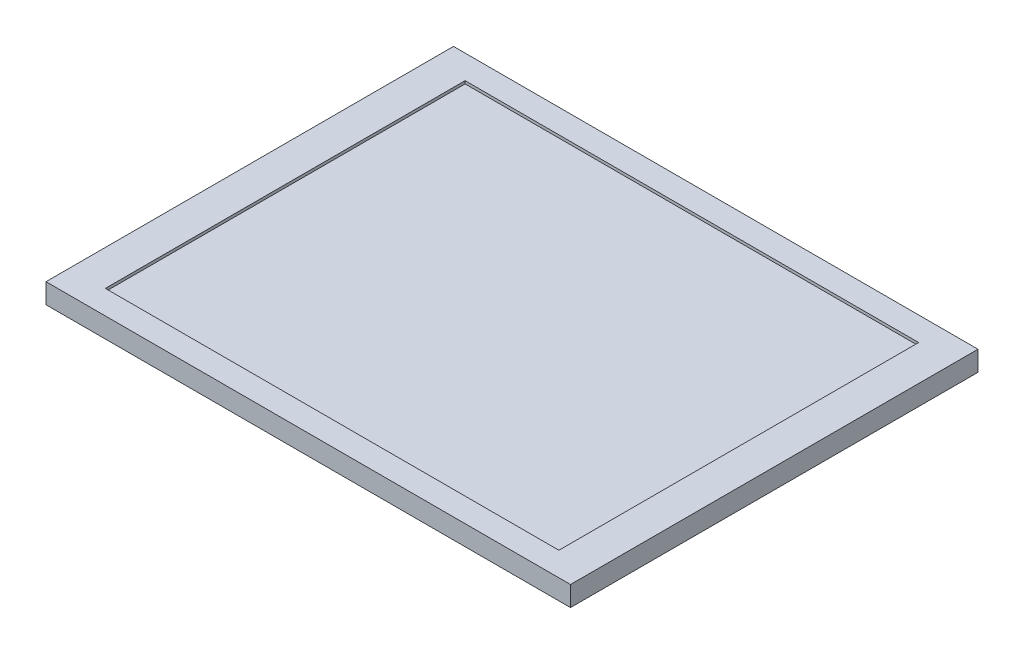
ISO-10303-21;
HEADER;
FILE_DESCRIPTION(('STEP AP214'),'2;1');
FILE_NAME('part.step','',(''),(''),'','','');
FILE_SCHEMA(('AUTOMOTIVE_DESIGN { 1 0 10303 214 1 1 1 1 }'));
ENDSEC;
DATA;
#1=APPLICATION_CONTEXT('core data for automotive mechanical design processes');
#2=APPLICATION_PROTOCOL_DEFINITION('international standard','automotive_design',2000,#1);
#3=PRODUCT_CONTEXT('',#1,'mechanical');
#4=PRODUCT('Part','Part','',(#3));
#5=PRODUCT_RELATED_PRODUCT_CATEGORY('part','',(#4));
#6=PRODUCT_DEFINITION_FORMATION('','',#4);
#7=PRODUCT_DEFINITION_CONTEXT('part definition',#1,'design');
#8=PRODUCT_DEFINITION('design','',#6,#7);
#9=PRODUCT_DEFINITION_SHAPE('','',#8);
#10=(LENGTH_UNIT() NAMED_UNIT(*) SI_UNIT(.MILLI.,.METRE.));
#11=(NAMED_UNIT(*) PLANE_ANGLE_UNIT() SI_UNIT($,.RADIAN.));
#12=(NAMED_UNIT(*) SI_UNIT($,.STERADIAN.) SOLID_ANGLE_UNIT());
#13=UNCERTAINTY_MEASURE_WITH_UNIT(LENGTH_MEASURE(1.E-05),#10,'distance_accuracy_value','');
#14=(GEOMETRIC_REPRESENTATION_CONTEXT(3) GLOBAL_UNCERTAINTY_ASSIGNED_CONTEXT((#13)) GLOBAL_UNIT_ASSIGNED_CONTEXT((#10,
#11,#12)) REPRESENTATION_CONTEXT('',''));
#15=CARTESIAN_POINT('',(0.,0.,0.));
#16=DIRECTION('',(0.,0.,1.));
#17=DIRECTION('',(1.,0.,0.));
#18=AXIS2_PLACEMENT_3D('',#15,#16,#17);
#19=CARTESIAN_POINT('',(139.,9.1,-108.));
#20=DIRECTION('',(-1.,0.,0.));
#21=DIRECTION('',(0.,0.,1.));
#22=AXIS2_PLACEMENT_3D('',#19,#20,#21);
#23=PLANE('',#22);
#24=DIRECTION('',(0.,0.,-1.));
#25=VECTOR('',#24,1.);
#26=CARTESIAN_POINT('',(139.,0.,-108.));
#27=LINE('',#26,#25);
#28=CARTESIAN_POINT('',(139.,0.,108.));
#29=VERTEX_POINT('',#28);
#30=CARTESIAN_POINT('',(139.,0.,-108.));
#31=VERTEX_POINT('',#30);
#32=EDGE_CURVE('E144',#29,#31,#27,.T.);
#33=ORIENTED_EDGE('',*,*,#32,.T.);
#34=DIRECTION('',(0.,-1.,0.));
#35=VECTOR('',#34,1.);
#36=CARTESIAN_POINT('',(139.,9.1,-108.));
#37=LINE('',#36,#35);
#38=CARTESIAN_POINT('',(139.,10.6,-108.));
#39=VERTEX_POINT('',#38);
#40=EDGE_CURVE('E11',#39,#31,#37,.T.);
#41=ORIENTED_EDGE('',*,*,#40,.F.);
#42=DIRECTION('',(0.,0.,-1.));
#43=VECTOR('',#42,1.);
#44=CARTESIAN_POINT('',(139.,10.6,-108.));
#45=LINE('',#44,#43);
#46=CARTESIAN_POINT('',(139.,10.6,108.));
#47=VERTEX_POINT('',#46);
#48=EDGE_CURVE('E138',#47,#39,#45,.T.);
#49=ORIENTED_EDGE('',*,*,#48,.F.);
#50=DIRECTION('',(0.,-1.,0.));
#51=VECTOR('',#50,1.);
#52=CARTESIAN_POINT('',(139.,9.1,108.));
#53=LINE('',#52,#51);
#54=EDGE_CURVE('E153',#47,#29,#53,.T.);
#55=ORIENTED_EDGE('',*,*,#54,.T.);
#56=EDGE_LOOP('',(#33,#41,#49,#55));
#57=FACE_BOUND('',#56,.T.);
#58=ADVANCED_FACE('F33',(#57),#23,.F.);
#59=CARTESIAN_POINT('',(-139.,9.1,-108.));
#60=DIRECTION('',(0.,0.,1.));
#61=DIRECTION('',(1.,0.,0.));
#62=AXIS2_PLACEMENT_3D('',#59,#60,#61);
#63=PLANE('',#62);
#64=DIRECTION('',(-1.,0.,0.));
#65=VECTOR('',#64,1.);
#66=CARTESIAN_POINT('',(-139.,0.,-108.));
#67=LINE('',#66,#65);
#68=CARTESIAN_POINT('',(-139.,0.,-108.));
#69=VERTEX_POINT('',#68);
#70=EDGE_CURVE('E147',#31,#69,#67,.T.);
#71=ORIENTED_EDGE('',*,*,#70,.T.);
#72=DIRECTION('',(0.,-1.,0.));
#73=VECTOR('',#72,1.);
#74=CARTESIAN_POINT('',(-139.,9.1,-108.));
#75=LINE('',#74,#73);
#76=CARTESIAN_POINT('',(-139.,10.6,-108.));
#77=VERTEX_POINT('',#76);
#78=EDGE_CURVE('E40',#77,#69,#75,.T.);
#79=ORIENTED_EDGE('',*,*,#78,.F.);
#80=DIRECTION('',(-1.,0.,0.));
#81=VECTOR('',#80,1.);
#82=CARTESIAN_POINT('',(139.,10.6,-108.));
#83=LINE('',#82,#81);
#84=EDGE_CURVE('E141',#39,#77,#83,.T.);
#85=ORIENTED_EDGE('',*,*,#84,.F.);
#86=ORIENTED_EDGE('',*,*,#40,.T.);
#87=EDGE_LOOP('',(#71,#79,#85,#86));
#88=FACE_BOUND('',#87,.T.);
#89=ADVANCED_FACE('F175',(#88),#63,.F.);
#90=CARTESIAN_POINT('',(-139.,9.1,-108.));
#91=DIRECTION('',(1.,0.,0.));
#92=DIRECTION('',(0.,0.,-1.));
#93=AXIS2_PLACEMENT_3D('',#90,#91,#92);
#94=PLANE('',#93);
#95=DIRECTION('',(0.,0.,1.));
#96=VECTOR('',#95,1.);
#97=CARTESIAN_POINT('',(-139.,0.,-108.));
#98=LINE('',#97,#96);
#99=CARTESIAN_POINT('',(-139.,0.,108.));
#100=VERTEX_POINT('',#99);
#101=EDGE_CURVE('E149',#69,#100,#98,.T.);
#102=ORIENTED_EDGE('',*,*,#101,.T.);
#103=DIRECTION('',(0.,-1.,0.));
#104=VECTOR('',#103,1.);
#105=CARTESIAN_POINT('',(-139.,9.1,108.));
#106=LINE('',#105,#104);
#107=CARTESIAN_POINT('',(-139.,10.6,108.));
#108=VERTEX_POINT('',#107);
#109=EDGE_CURVE('E156',#108,#100,#106,.T.);
#110=ORIENTED_EDGE('',*,*,#109,.F.);
#111=DIRECTION('',(0.,0.,1.));
#112=VECTOR('',#111,1.);
#113=CARTESIAN_POINT('',(-139.,10.6,-108.));
#114=LINE('',#113,#112);
#115=EDGE_CURVE('E111',#77,#108,#114,.T.);
#116=ORIENTED_EDGE('',*,*,#115,.F.);
#117=ORIENTED_EDGE('',*,*,#78,.T.);
#118=EDGE_LOOP('',(#102,#110,#116,#117));
#119=FACE_BOUND('',#118,.T.);
#120=ADVANCED_FACE('F162',(#119),#94,.F.);
#121=CARTESIAN_POINT('',(-139.,9.1,108.));
#122=DIRECTION('',(0.,0.,-1.));
#123=DIRECTION('',(-1.,0.,0.));
#124=AXIS2_PLACEMENT_3D('',#121,#122,#123);
#125=PLANE('',#124);
#126=DIRECTION('',(1.,0.,0.));
#127=VECTOR('',#126,1.);
#128=CARTESIAN_POINT('',(-139.,0.,108.));
#129=LINE('',#128,#127);
#130=EDGE_CURVE('E151',#100,#29,#129,.T.);
#131=ORIENTED_EDGE('',*,*,#130,.T.);
#132=ORIENTED_EDGE('',*,*,#54,.F.);
#133=DIRECTION('',(1.,0.,0.));
#134=VECTOR('',#133,1.);
#135=CARTESIAN_POINT('',(-139.,10.6,108.));
#136=LINE('',#135,#134);
#137=EDGE_CURVE('E135',#108,#47,#136,.T.);
#138=ORIENTED_EDGE('',*,*,#137,.F.);
#139=ORIENTED_EDGE('',*,*,#109,.T.);
#140=EDGE_LOOP('',(#131,#132,#138,#139));
#141=FACE_BOUND('',#140,.T.);
#142=ADVANCED_FACE('F170',(#141),#125,.F.);
#143=CARTESIAN_POINT('',(0.,0.,0.));
#144=DIRECTION('',(0.,1.,0.));
#145=DIRECTION('',(0.,0.,1.));
#146=AXIS2_PLACEMENT_3D('',#143,#144,#145);
#147=PLANE('',#146);
#148=ORIENTED_EDGE('',*,*,#32,.F.);
#149=ORIENTED_EDGE('',*,*,#130,.F.);
#150=ORIENTED_EDGE('',*,*,#101,.F.);
#151=ORIENTED_EDGE('',*,*,#70,.F.);
#152=EDGE_LOOP('',(#148,#149,#150,#151));
#153=FACE_BOUND('',#152,.T.);
#154=ADVANCED_FACE('F168',(#153),#147,.F.);
#155=CARTESIAN_POINT('',(0.,10.6,0.));
#156=DIRECTION('',(0.,1.,0.));
#157=DIRECTION('',(0.,0.,1.));
#158=AXIS2_PLACEMENT_3D('',#155,#156,#157);
#159=PLANE('',#158);
#160=ORIENTED_EDGE('',*,*,#115,.T.);
#161=ORIENTED_EDGE('',*,*,#137,.T.);
#162=ORIENTED_EDGE('',*,*,#48,.T.);
#163=ORIENTED_EDGE('',*,*,#84,.T.);
#164=EDGE_LOOP('',(#160,#161,#162,#163));
#165=FACE_BOUND('',#164,.T.);
#166=DIRECTION('',(0.,0.,1.));
#167=VECTOR('',#166,1.);
#168=CARTESIAN_POINT('',(-120.2,10.6,-95.35));
#169=LINE('',#168,#167);
#170=CARTESIAN_POINT('',(-120.2,10.6,-95.35));
#171=VERTEX_POINT('',#170);
#172=CARTESIAN_POINT('',(-120.2,10.6,95.35));
#173=VERTEX_POINT('',#172);
#174=EDGE_CURVE('E105',#171,#173,#169,.T.);
#175=ORIENTED_EDGE('',*,*,#174,.F.);
#176=DIRECTION('',(-1.,0.,0.));
#177=VECTOR('',#176,1.);
#178=CARTESIAN_POINT('',(-120.2,10.6,-95.35));
#179=LINE('',#178,#177);
#180=CARTESIAN_POINT('',(120.2,10.6,-95.35));
#181=VERTEX_POINT('',#180);
#182=EDGE_CURVE('E96',#181,#171,#179,.T.);
#183=ORIENTED_EDGE('',*,*,#182,.F.);
#184=DIRECTION('',(0.,0.,-1.));
#185=VECTOR('',#184,1.);
#186=CARTESIAN_POINT('',(120.2,10.6,-95.35));
#187=LINE('',#186,#185);
#188=CARTESIAN_POINT('',(120.2,10.6,95.3500000000002));
#189=VERTEX_POINT('',#188);
#190=EDGE_CURVE('E119',#189,#181,#187,.T.);
#191=ORIENTED_EDGE('',*,*,#190,.F.);
#192=DIRECTION('',(1.,0.,0.));
#193=VECTOR('',#192,1.);
#194=CARTESIAN_POINT('',(-120.2,10.6,95.35));
#195=LINE('',#194,#193);
#196=EDGE_CURVE('E117',#173,#189,#195,.T.);
#197=ORIENTED_EDGE('',*,*,#196,.F.);
#198=EDGE_LOOP('',(#175,#183,#191,#197));
#199=FACE_BOUND('',#198,.T.);
#200=ADVANCED_FACE('F115',(#165,#199),#159,.T.);
#201=CARTESIAN_POINT('',(-120.2,10.6,-95.35));
#202=DIRECTION('',(0.,0.,1.));
#203=DIRECTION('',(1.,0.,0.));
#204=AXIS2_PLACEMENT_3D('',#201,#202,#203);
#205=PLANE('',#204);
#206=DIRECTION('',(-1.,0.,0.));
#207=VECTOR('',#206,1.);
#208=CARTESIAN_POINT('',(-120.2,9.1,-95.35));
#209=LINE('',#208,#207);
#210=CARTESIAN_POINT('',(120.2,9.1,-95.35));
#211=VERTEX_POINT('',#210);
#212=CARTESIAN_POINT('',(-120.2,9.1,-95.35));
#213=VERTEX_POINT('',#212);
#214=EDGE_CURVE('E47',#211,#213,#209,.T.);
#215=ORIENTED_EDGE('',*,*,#214,.F.);
#216=DIRECTION('',(0.,-1.,0.));
#217=VECTOR('',#216,1.);
#218=CARTESIAN_POINT('',(120.2,10.6,-95.35));
#219=LINE('',#218,#217);
#220=EDGE_CURVE('E101',#181,#211,#219,.T.);
#221=ORIENTED_EDGE('',*,*,#220,.F.);
#222=ORIENTED_EDGE('',*,*,#182,.T.);
#223=DIRECTION('',(0.,-1.,0.));
#224=VECTOR('',#223,1.);
#225=CARTESIAN_POINT('',(-120.2,10.6,-95.35));
#226=LINE('',#225,#224);
#227=EDGE_CURVE('E99',#171,#213,#226,.T.);
#228=ORIENTED_EDGE('',*,*,#227,.T.);
#229=EDGE_LOOP('',(#215,#221,#222,#228));
#230=FACE_BOUND('',#229,.T.);
#231=ADVANCED_FACE('F98',(#230),#205,.T.);
#232=CARTESIAN_POINT('',(-120.2,10.6,-95.35));
#233=DIRECTION('',(1.,0.,0.));
#234=DIRECTION('',(0.,0.,-1.));
#235=AXIS2_PLACEMENT_3D('',#232,#233,#234);
#236=PLANE('',#235);
#237=DIRECTION('',(0.,0.,1.));
#238=VECTOR('',#237,1.);
#239=CARTESIAN_POINT('',(-120.2,9.1,-95.35));
#240=LINE('',#239,#238);
#241=CARTESIAN_POINT('',(-120.2,9.1,95.35));
#242=VERTEX_POINT('',#241);
#243=EDGE_CURVE('E51',#213,#242,#240,.T.);
#244=ORIENTED_EDGE('',*,*,#243,.F.);
#245=ORIENTED_EDGE('',*,*,#227,.F.);
#246=ORIENTED_EDGE('',*,*,#174,.T.);
#247=DIRECTION('',(0.,-1.,0.));
#248=VECTOR('',#247,1.);
#249=CARTESIAN_POINT('',(-120.2,10.6,95.35));
#250=LINE('',#249,#248);
#251=EDGE_CURVE('E112',#173,#242,#250,.T.);
#252=ORIENTED_EDGE('',*,*,#251,.T.);
#253=EDGE_LOOP('',(#244,#245,#246,#252));
#254=FACE_BOUND('',#253,.T.);
#255=ADVANCED_FACE('F109',(#254),#236,.T.);
#256=CARTESIAN_POINT('',(-120.2,10.6,95.35));
#257=DIRECTION('',(0.,0.,-1.));
#258=DIRECTION('',(-1.,0.,0.));
#259=AXIS2_PLACEMENT_3D('',#256,#257,#258);
#260=PLANE('',#259);
#261=DIRECTION('',(1.,0.,0.));
#262=VECTOR('',#261,1.);
#263=CARTESIAN_POINT('',(-120.2,9.1,95.35));
#264=LINE('',#263,#262);
#265=CARTESIAN_POINT('',(120.2,9.1,95.3500000000002));
#266=VERTEX_POINT('',#265);
#267=EDGE_CURVE('E125',#242,#266,#264,.T.);
#268=ORIENTED_EDGE('',*,*,#267,.F.);
#269=ORIENTED_EDGE('',*,*,#251,.F.);
#270=ORIENTED_EDGE('',*,*,#196,.T.);
#271=DIRECTION('',(0.,-1.,0.));
#272=VECTOR('',#271,1.);
#273=CARTESIAN_POINT('',(120.2,10.6,95.3500000000002));
#274=LINE('',#273,#272);
#275=EDGE_CURVE('E129',#189,#266,#274,.T.);
#276=ORIENTED_EDGE('',*,*,#275,.T.);
#277=EDGE_LOOP('',(#268,#269,#270,#276));
#278=FACE_BOUND('',#277,.T.);
#279=ADVANCED_FACE('F197',(#278),#260,.T.);
#280=CARTESIAN_POINT('',(120.2,10.6,-95.35));
#281=DIRECTION('',(-1.,0.,0.));
#282=DIRECTION('',(0.,0.,1.));
#283=AXIS2_PLACEMENT_3D('',#280,#281,#282);
#284=PLANE('',#283);
#285=DIRECTION('',(0.,0.,-1.));
#286=VECTOR('',#285,1.);
#287=CARTESIAN_POINT('',(120.2,9.1,-95.35));
#288=LINE('',#287,#286);
#289=EDGE_CURVE('E106',#266,#211,#288,.T.);
#290=ORIENTED_EDGE('',*,*,#289,.F.);
#291=ORIENTED_EDGE('',*,*,#275,.F.);
#292=ORIENTED_EDGE('',*,*,#190,.T.);
#293=ORIENTED_EDGE('',*,*,#220,.T.);
#294=EDGE_LOOP('',(#290,#291,#292,#293));
#295=FACE_BOUND('',#294,.T.);
#296=ADVANCED_FACE('F190',(#295),#284,.T.);
#297=CARTESIAN_POINT('',(0.,9.1,0.));
#298=DIRECTION('',(0.,1.,0.));
#299=DIRECTION('',(0.,0.,1.));
#300=AXIS2_PLACEMENT_3D('',#297,#298,#299);
#301=PLANE('',#300);
#302=ORIENTED_EDGE('',*,*,#214,.T.);
#303=ORIENTED_EDGE('',*,*,#243,.T.);
#304=ORIENTED_EDGE('',*,*,#267,.T.);
#305=ORIENTED_EDGE('',*,*,#289,.T.);
#306=EDGE_LOOP('',(#302,#303,#304,#305));
#307=FACE_BOUND('',#306,.T.);
#308=ADVANCED_FACE('F187',(#307),#301,.T.);
#309=CLOSED_SHELL('',(#58,#89,#120,#142,#154,#200,#231,#255,#279,#296,#308));
#310=MANIFOLD_SOLID_BREP('B2',#309);
#311=ADVANCED_BREP_SHAPE_REPRESENTATION('',(#18,#310),#14);
#312=SHAPE_DEFINITION_REPRESENTATION(#9,#311);
ENDSEC;
END-ISO-10303-21;
